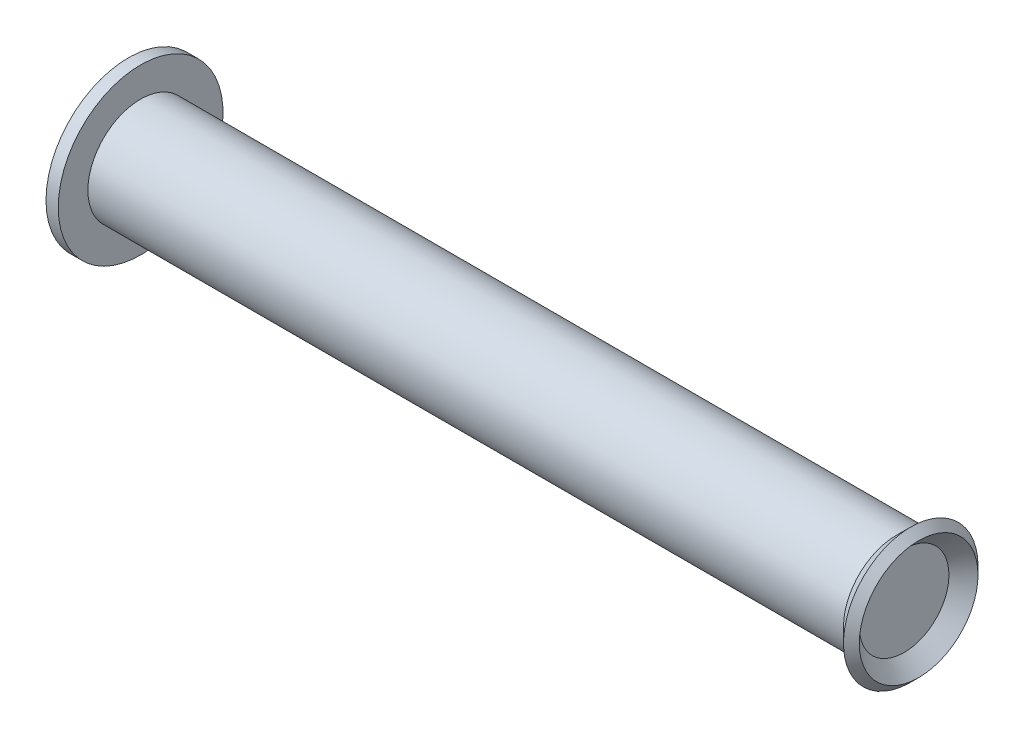
ISO-10303-21;
HEADER;
FILE_DESCRIPTION(('STEP AP214'),'2;1');
FILE_NAME('part.step','',(''),(''),'','','');
FILE_SCHEMA(('AUTOMOTIVE_DESIGN { 1 0 10303 214 1 1 1 1 }'));
ENDSEC;
DATA;
#1=APPLICATION_CONTEXT('core data for automotive mechanical design processes');
#2=APPLICATION_PROTOCOL_DEFINITION('international standard','automotive_design',2000,#1);
#3=PRODUCT_CONTEXT('',#1,'mechanical');
#4=PRODUCT('Part','Part','',(#3));
#5=PRODUCT_RELATED_PRODUCT_CATEGORY('part','',(#4));
#6=PRODUCT_DEFINITION_FORMATION('','',#4);
#7=PRODUCT_DEFINITION_CONTEXT('part definition',#1,'design');
#8=PRODUCT_DEFINITION('design','',#6,#7);
#9=PRODUCT_DEFINITION_SHAPE('','',#8);
#10=(LENGTH_UNIT() NAMED_UNIT(*) SI_UNIT(.MILLI.,.METRE.));
#11=(NAMED_UNIT(*) PLANE_ANGLE_UNIT() SI_UNIT($,.RADIAN.));
#12=(NAMED_UNIT(*) SI_UNIT($,.STERADIAN.) SOLID_ANGLE_UNIT());
#13=UNCERTAINTY_MEASURE_WITH_UNIT(LENGTH_MEASURE(1.E-05),#10,'distance_accuracy_value','');
#14=(GEOMETRIC_REPRESENTATION_CONTEXT(3) GLOBAL_UNCERTAINTY_ASSIGNED_CONTEXT((#13)) GLOBAL_UNIT_ASSIGNED_CONTEXT((#10,
#11,#12)) REPRESENTATION_CONTEXT('',''));
#15=CARTESIAN_POINT('',(0.,0.,0.));
#16=DIRECTION('',(0.,0.,1.));
#17=DIRECTION('',(1.,0.,0.));
#18=AXIS2_PLACEMENT_3D('',#15,#16,#17);
#19=CARTESIAN_POINT('',(8.78030257921069,-1.0203948775786,0.));
#20=DIRECTION('',(1.,0.,0.));
#21=DIRECTION('',(0.,0.,-1.));
#22=AXIS2_PLACEMENT_3D('',#19,#20,#21);
#23=PLANE('',#22);
#24=CARTESIAN_POINT('',(8.78030257922546,0.,0.));
#25=DIRECTION('',(1.,0.,0.));
#26=DIRECTION('',(0.,0.,-1.));
#27=AXIS2_PLACEMENT_3D('',#24,#25,#26);
#28=CIRCLE('',#27,1.02039487757111);
#29=CARTESIAN_POINT('',(8.78030257922546,0.,-1.02039487757111));
#30=VERTEX_POINT('',#29);
#31=EDGE_CURVE('E41',#30,#30,#28,.T.);
#32=ORIENTED_EDGE('',*,*,#31,.T.);
#33=EDGE_LOOP('',(#32));
#34=FACE_BOUND('',#33,.T.);
#35=ADVANCED_FACE('F17',(#34),#23,.T.);
#36=CARTESIAN_POINT('',(-9.10869745678931,0.,0.));
#37=DIRECTION('',(-1.,0.,0.));
#38=DIRECTION('',(0.,0.,1.));
#39=AXIS2_PLACEMENT_3D('',#36,#37,#38);
#40=PLANE('',#39);
#41=CARTESIAN_POINT('',(-9.10869745678931,0.,0.));
#42=DIRECTION('',(1.,0.,0.));
#43=DIRECTION('',(0.,0.,-1.));
#44=AXIS2_PLACEMENT_3D('',#41,#42,#43);
#45=CIRCLE('',#44,0.127);
#46=CARTESIAN_POINT('',(-9.10869745678931,0.,-0.126999999999999));
#47=VERTEX_POINT('',#46);
#48=CARTESIAN_POINT('',(-9.10869745678931,0.,0.126999999999999));
#49=VERTEX_POINT('',#48);
#50=EDGE_CURVE('E34',#47,#49,#45,.T.);
#51=ORIENTED_EDGE('',*,*,#50,.F.);
#52=CARTESIAN_POINT('',(-9.10869745678931,0.,0.));
#53=DIRECTION('',(1.,0.,0.));
#54=DIRECTION('',(0.,0.,1.));
#55=AXIS2_PLACEMENT_3D('',#52,#53,#54);
#56=CIRCLE('',#55,0.127);
#57=EDGE_CURVE('E39',#49,#47,#56,.T.);
#58=ORIENTED_EDGE('',*,*,#57,.F.);
#59=EDGE_LOOP('',(#51,#58));
#60=FACE_BOUND('',#59,.T.);
#61=ADVANCED_FACE('F38',(#60),#40,.T.);
#62=CARTESIAN_POINT('',(9.11104969515009,0.,0.));
#63=DIRECTION('',(1.,0.,0.));
#64=DIRECTION('',(0.,0.,-1.));
#65=AXIS2_PLACEMENT_3D('',#62,#63,#64);
#66=CONICAL_SURFACE('',#65,1.35114199349573,0.785398163397448);
#67=ORIENTED_EDGE('',*,*,#31,.F.);
#68=EDGE_LOOP('',(#67));
#69=FACE_BOUND('',#68,.T.);
#70=CARTESIAN_POINT('',(9.11104969526377,0.,0.));
#71=DIRECTION('',(-1.,0.,0.));
#72=DIRECTION('',(0.,0.,1.));
#73=AXIS2_PLACEMENT_3D('',#70,#71,#72);
#74=CIRCLE('',#73,1.35114199355257);
#75=CARTESIAN_POINT('',(9.11104969526377,0.,1.35114199355257));
#76=VERTEX_POINT('',#75);
#77=EDGE_CURVE('E46',#76,#76,#74,.T.);
#78=ORIENTED_EDGE('',*,*,#77,.F.);
#79=EDGE_LOOP('',(#78));
#80=FACE_BOUND('',#79,.T.);
#81=ADVANCED_FACE('F65',(#69,#80),#66,.F.);
#82=CARTESIAN_POINT('',(-2.33470525042833,0.,0.126999999999999));
#83=DIRECTION('',(0.,1.,0.));
#84=DIRECTION('',(0.,0.,1.));
#85=AXIS2_PLACEMENT_3D('',#82,#83,#84);
#86=CIRCLE('',#85,6.77399220636098);
#87=TRIMMED_CURVE('',#86,(PARAMETER_VALUE(-1.5895456015603)),(PARAMETER_VALUE(1.5895456015603)),
.T.,.PARAMETER.);
#88=CARTESIAN_POINT('',(-2.33470525042833,0.,0.));
#89=DIRECTION('',(-1.,0.,0.));
#90=AXIS1_PLACEMENT('',#88,#89);
#91=SURFACE_OF_REVOLUTION('',#87,#90);
#92=CARTESIAN_POINT('',(-8.87928059278931,0.,0.));
#93=DIRECTION('',(-1.,0.,0.));
#94=DIRECTION('',(0.,0.,1.));
#95=AXIS2_PLACEMENT_3D('',#92,#93,#94);
#96=CIRCLE('',#95,1.875);
#97=CARTESIAN_POINT('',(-8.87928059278931,0.,1.875));
#98=VERTEX_POINT('',#97);
#99=EDGE_CURVE('E74',#98,#98,#96,.F.);
#100=ORIENTED_EDGE('',*,*,#99,.F.);
#101=EDGE_LOOP('',(#100));
#102=FACE_BOUND('',#101,.T.);
#103=ORIENTED_EDGE('',*,*,#57,.T.);
#104=ORIENTED_EDGE('',*,*,#50,.T.);
#105=EDGE_LOOP('',(#103,#104));
#106=FACE_BOUND('',#105,.T.);
#107=ADVANCED_FACE('F45',(#102,#106),#91,.F.);
#108=CARTESIAN_POINT('',(8.93144457290873,0.,0.));
#109=DIRECTION('',(-1.,0.,0.));
#110=DIRECTION('',(0.,0.,1.));
#111=AXIS2_PLACEMENT_3D('',#108,#109,#110);
#112=CONICAL_SURFACE('',#111,1.53074711590762,0.785398163397448);
#113=CARTESIAN_POINT('',(8.93144457279504,0.,0.));
#114=DIRECTION('',(1.,0.,0.));
#115=DIRECTION('',(0.,0.,-1.));
#116=AXIS2_PLACEMENT_3D('',#113,#114,#115);
#117=CIRCLE('',#116,1.53074711590762);
#118=CARTESIAN_POINT('',(8.93144457279504,0.,-1.53074711590762));
#119=VERTEX_POINT('',#118);
#120=EDGE_CURVE('E72',#119,#119,#117,.F.);
#121=ORIENTED_EDGE('',*,*,#120,.F.);
#122=EDGE_LOOP('',(#121));
#123=FACE_BOUND('',#122,.T.);
#124=ORIENTED_EDGE('',*,*,#77,.T.);
#125=EDGE_LOOP('',(#124));
#126=FACE_BOUND('',#125,.T.);
#127=ADVANCED_FACE('F64',(#123,#126),#112,.T.);
#128=CARTESIAN_POINT('',(0.,0.,0.));
#129=DIRECTION('',(-1.,0.,0.));
#130=DIRECTION('',(0.,0.,1.));
#131=AXIS2_PLACEMENT_3D('',#128,#129,#130);
#132=CYLINDRICAL_SURFACE('',#131,1.875);
#133=CARTESIAN_POINT('',(-8.60069745678931,0.,0.));
#134=DIRECTION('',(-1.,0.,0.));
#135=DIRECTION('',(0.,0.,1.));
#136=AXIS2_PLACEMENT_3D('',#133,#134,#135);
#137=CIRCLE('',#136,1.875);
#138=CARTESIAN_POINT('',(-8.60069745678931,0.,1.875));
#139=VERTEX_POINT('',#138);
#140=EDGE_CURVE('E112',#139,#139,#137,.F.);
#141=ORIENTED_EDGE('',*,*,#140,.F.);
#142=EDGE_LOOP('',(#141));
#143=FACE_BOUND('',#142,.T.);
#144=ORIENTED_EDGE('',*,*,#99,.T.);
#145=EDGE_LOOP('',(#144));
#146=FACE_BOUND('',#145,.T.);
#147=ADVANCED_FACE('F101',(#143,#146),#132,.T.);
#148=CARTESIAN_POINT('',(8.93144457279504,0.,0.));
#149=DIRECTION('',(1.,0.,0.));
#150=DIRECTION('',(0.,0.,-1.));
#151=AXIS2_PLACEMENT_3D('',#148,#149,#150);
#152=CONICAL_SURFACE('',#151,1.53074711590762,0.785398163397448);
#153=ORIENTED_EDGE('',*,*,#120,.T.);
#154=EDGE_LOOP('',(#153));
#155=FACE_BOUND('',#154,.T.);
#156=CARTESIAN_POINT('',(8.6006974567893,0.,0.));
#157=DIRECTION('',(-1.,0.,0.));
#158=DIRECTION('',(0.,0.,1.));
#159=AXIS2_PLACEMENT_3D('',#156,#157,#158);
#160=CIRCLE('',#159,1.2);
#161=CARTESIAN_POINT('',(8.6006974567893,0.,1.2));
#162=VERTEX_POINT('',#161);
#163=EDGE_CURVE('E28',#162,#162,#160,.T.);
#164=ORIENTED_EDGE('',*,*,#163,.F.);
#165=EDGE_LOOP('',(#164));
#166=FACE_BOUND('',#165,.T.);
#167=ADVANCED_FACE('F95',(#155,#166),#152,.T.);
#168=CARTESIAN_POINT('',(-8.60069745678931,-1.875,0.));
#169=DIRECTION('',(1.,0.,0.));
#170=DIRECTION('',(0.,0.,-1.));
#171=AXIS2_PLACEMENT_3D('',#168,#169,#170);
#172=PLANE('',#171);
#173=ORIENTED_EDGE('',*,*,#140,.T.);
#174=EDGE_LOOP('',(#173));
#175=FACE_BOUND('',#174,.T.);
#176=CARTESIAN_POINT('',(-8.60069745678931,0.,0.));
#177=DIRECTION('',(-1.,0.,0.));
#178=DIRECTION('',(0.,0.,1.));
#179=AXIS2_PLACEMENT_3D('',#176,#177,#178);
#180=CIRCLE('',#179,1.2);
#181=CARTESIAN_POINT('',(-8.60069745678931,0.,1.2));
#182=VERTEX_POINT('',#181);
#183=EDGE_CURVE('E11',#182,#182,#180,.F.);
#184=ORIENTED_EDGE('',*,*,#183,.F.);
#185=EDGE_LOOP('',(#184));
#186=FACE_BOUND('',#185,.T.);
#187=ADVANCED_FACE('F89',(#175,#186),#172,.T.);
#188=CARTESIAN_POINT('',(0.,0.,0.));
#189=DIRECTION('',(-1.,0.,0.));
#190=DIRECTION('',(0.,0.,1.));
#191=AXIS2_PLACEMENT_3D('',#188,#189,#190);
#192=CYLINDRICAL_SURFACE('',#191,1.2);
#193=ORIENTED_EDGE('',*,*,#183,.T.);
#194=EDGE_LOOP('',(#193));
#195=FACE_BOUND('',#194,.T.);
#196=ORIENTED_EDGE('',*,*,#163,.T.);
#197=EDGE_LOOP('',(#196));
#198=FACE_BOUND('',#197,.T.);
#199=ADVANCED_FACE('F87',(#195,#198),#192,.T.);
#200=CLOSED_SHELL('',(#35,#61,#81,#107,#127,#147,#167,#187,#199));
#201=MANIFOLD_SOLID_BREP('B1',#200);
#202=ADVANCED_BREP_SHAPE_REPRESENTATION('',(#18,#201),#14);
#203=SHAPE_DEFINITION_REPRESENTATION(#9,#202);
ENDSEC;
END-ISO-10303-21;
